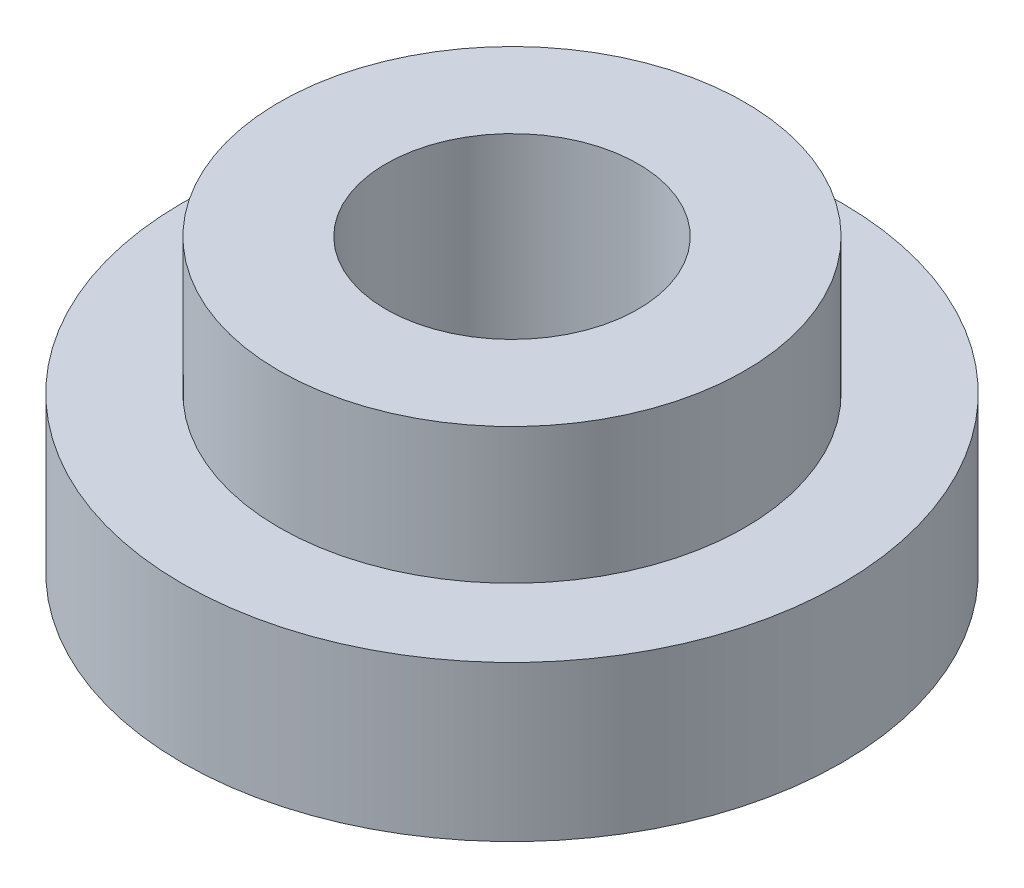
ISO-10303-21;
HEADER;
FILE_DESCRIPTION(('STEP AP214'),'2;1');
FILE_NAME('part.step','',(''),(''),'','','');
FILE_SCHEMA(('AUTOMOTIVE_DESIGN { 1 0 10303 214 1 1 1 1 }'));
ENDSEC;
DATA;
#1=APPLICATION_CONTEXT('core data for automotive mechanical design processes');
#2=APPLICATION_PROTOCOL_DEFINITION('international standard','automotive_design',2000,#1);
#3=PRODUCT_CONTEXT('',#1,'mechanical');
#4=PRODUCT('Part','Part','',(#3));
#5=PRODUCT_RELATED_PRODUCT_CATEGORY('part','',(#4));
#6=PRODUCT_DEFINITION_FORMATION('','',#4);
#7=PRODUCT_DEFINITION_CONTEXT('part definition',#1,'design');
#8=PRODUCT_DEFINITION('design','',#6,#7);
#9=PRODUCT_DEFINITION_SHAPE('','',#8);
#10=(LENGTH_UNIT() NAMED_UNIT(*) SI_UNIT(.MILLI.,.METRE.));
#11=(NAMED_UNIT(*) PLANE_ANGLE_UNIT() SI_UNIT($,.RADIAN.));
#12=(NAMED_UNIT(*) SI_UNIT($,.STERADIAN.) SOLID_ANGLE_UNIT());
#13=UNCERTAINTY_MEASURE_WITH_UNIT(LENGTH_MEASURE(1.E-05),#10,'distance_accuracy_value','');
#14=(GEOMETRIC_REPRESENTATION_CONTEXT(3) GLOBAL_UNCERTAINTY_ASSIGNED_CONTEXT((#13)) GLOBAL_UNIT_ASSIGNED_CONTEXT((#10,
#11,#12)) REPRESENTATION_CONTEXT('',''));
#15=CARTESIAN_POINT('',(0.,0.,0.));
#16=DIRECTION('',(0.,0.,1.));
#17=DIRECTION('',(1.,0.,0.));
#18=AXIS2_PLACEMENT_3D('',#15,#16,#17);
#19=CARTESIAN_POINT('',(0.,2.032,0.));
#20=DIRECTION('',(0.,-1.,0.));
#21=DIRECTION('',(0.,0.,-1.));
#22=AXIS2_PLACEMENT_3D('',#19,#20,#21);
#23=CYLINDRICAL_SURFACE('',#22,4.318);
#24=CARTESIAN_POINT('',(0.,2.032,0.));
#25=DIRECTION('',(0.,1.,0.));
#26=DIRECTION('',(0.,0.,1.));
#27=AXIS2_PLACEMENT_3D('',#24,#25,#26);
#28=CIRCLE('',#27,4.318);
#29=CARTESIAN_POINT('',(0.,2.032,4.318));
#30=VERTEX_POINT('',#29);
#31=EDGE_CURVE('E41',#30,#30,#28,.T.);
#32=ORIENTED_EDGE('',*,*,#31,.F.);
#33=EDGE_LOOP('',(#32));
#34=FACE_BOUND('',#33,.T.);
#35=CARTESIAN_POINT('',(0.,0.,0.));
#36=DIRECTION('',(0.,1.,0.));
#37=DIRECTION('',(0.,0.,1.));
#38=AXIS2_PLACEMENT_3D('',#35,#36,#37);
#39=CIRCLE('',#38,4.318);
#40=CARTESIAN_POINT('',(0.,0.,4.318));
#41=VERTEX_POINT('',#40);
#42=EDGE_CURVE('E37',#41,#41,#39,.T.);
#43=ORIENTED_EDGE('',*,*,#42,.T.);
#44=EDGE_LOOP('',(#43));
#45=FACE_BOUND('',#44,.T.);
#46=ADVANCED_FACE('F34',(#34,#45),#23,.T.);
#47=CARTESIAN_POINT('',(0.,2.032,0.));
#48=DIRECTION('',(0.,1.,0.));
#49=DIRECTION('',(0.,0.,1.));
#50=AXIS2_PLACEMENT_3D('',#47,#48,#49);
#51=PLANE('',#50);
#52=CARTESIAN_POINT('',(0.,2.032,0.));
#53=DIRECTION('',(0.,1.,0.));
#54=DIRECTION('',(0.,0.,1.));
#55=AXIS2_PLACEMENT_3D('',#52,#53,#54);
#56=CIRCLE('',#55,3.048);
#57=CARTESIAN_POINT('',(0.,2.032,3.048));
#58=VERTEX_POINT('',#57);
#59=EDGE_CURVE('E10',#58,#58,#56,.T.);
#60=ORIENTED_EDGE('',*,*,#59,.F.);
#61=EDGE_LOOP('',(#60));
#62=FACE_BOUND('',#61,.T.);
#63=ORIENTED_EDGE('',*,*,#31,.T.);
#64=EDGE_LOOP('',(#63));
#65=FACE_BOUND('',#64,.T.);
#66=ADVANCED_FACE('F78',(#62,#65),#51,.T.);
#67=CARTESIAN_POINT('',(0.,0.,0.));
#68=DIRECTION('',(0.,1.,0.));
#69=DIRECTION('',(0.,0.,1.));
#70=AXIS2_PLACEMENT_3D('',#67,#68,#69);
#71=PLANE('',#70);
#72=CARTESIAN_POINT('',(0.,0.,0.));
#73=DIRECTION('',(0.,1.,0.));
#74=DIRECTION('',(0.,0.,1.));
#75=AXIS2_PLACEMENT_3D('',#72,#73,#74);
#76=CIRCLE('',#75,1.651);
#77=CARTESIAN_POINT('',(0.,0.,1.651));
#78=VERTEX_POINT('',#77);
#79=EDGE_CURVE('E50',#78,#78,#76,.T.);
#80=ORIENTED_EDGE('',*,*,#79,.T.);
#81=EDGE_LOOP('',(#80));
#82=FACE_BOUND('',#81,.T.);
#83=ORIENTED_EDGE('',*,*,#42,.F.);
#84=EDGE_LOOP('',(#83));
#85=FACE_BOUND('',#84,.T.);
#86=ADVANCED_FACE('F57',(#82,#85),#71,.F.);
#87=CARTESIAN_POINT('',(0.,3.81,0.));
#88=DIRECTION('',(0.,-1.,0.));
#89=DIRECTION('',(0.,0.,-1.));
#90=AXIS2_PLACEMENT_3D('',#87,#88,#89);
#91=CYLINDRICAL_SURFACE('',#90,3.048);
#92=CARTESIAN_POINT('',(0.,3.81,0.));
#93=DIRECTION('',(0.,1.,0.));
#94=DIRECTION('',(0.,0.,1.));
#95=AXIS2_PLACEMENT_3D('',#92,#93,#94);
#96=CIRCLE('',#95,3.048);
#97=CARTESIAN_POINT('',(0.,3.81,3.048));
#98=VERTEX_POINT('',#97);
#99=EDGE_CURVE('E47',#98,#98,#96,.T.);
#100=ORIENTED_EDGE('',*,*,#99,.F.);
#101=EDGE_LOOP('',(#100));
#102=FACE_BOUND('',#101,.T.);
#103=ORIENTED_EDGE('',*,*,#59,.T.);
#104=EDGE_LOOP('',(#103));
#105=FACE_BOUND('',#104,.T.);
#106=ADVANCED_FACE('F69',(#102,#105),#91,.T.);
#107=CARTESIAN_POINT('',(0.,3.81,0.));
#108=DIRECTION('',(0.,1.,0.));
#109=DIRECTION('',(0.,0.,1.));
#110=AXIS2_PLACEMENT_3D('',#107,#108,#109);
#111=PLANE('',#110);
#112=CARTESIAN_POINT('',(0.,3.81,0.));
#113=DIRECTION('',(0.,1.,0.));
#114=DIRECTION('',(0.,0.,1.));
#115=AXIS2_PLACEMENT_3D('',#112,#113,#114);
#116=CIRCLE('',#115,1.651);
#117=CARTESIAN_POINT('',(0.,3.81,1.651));
#118=VERTEX_POINT('',#117);
#119=EDGE_CURVE('E51',#118,#118,#116,.T.);
#120=ORIENTED_EDGE('',*,*,#119,.F.);
#121=EDGE_LOOP('',(#120));
#122=FACE_BOUND('',#121,.T.);
#123=ORIENTED_EDGE('',*,*,#99,.T.);
#124=EDGE_LOOP('',(#123));
#125=FACE_BOUND('',#124,.T.);
#126=ADVANCED_FACE('F63',(#122,#125),#111,.T.);
#127=CARTESIAN_POINT('',(0.,0.,0.));
#128=DIRECTION('',(0.,1.,0.));
#129=DIRECTION('',(0.,0.,1.));
#130=AXIS2_PLACEMENT_3D('',#127,#128,#129);
#131=CYLINDRICAL_SURFACE('',#130,1.651);
#132=ORIENTED_EDGE('',*,*,#79,.F.);
#133=EDGE_LOOP('',(#132));
#134=FACE_BOUND('',#133,.T.);
#135=ORIENTED_EDGE('',*,*,#119,.T.);
#136=EDGE_LOOP('',(#135));
#137=FACE_BOUND('',#136,.T.);
#138=ADVANCED_FACE('F60',(#134,#137),#131,.F.);
#139=CLOSED_SHELL('',(#46,#66,#86,#106,#126,#138));
#140=MANIFOLD_SOLID_BREP('B2',#139);
#141=ADVANCED_BREP_SHAPE_REPRESENTATION('',(#18,#140),#14);
#142=SHAPE_DEFINITION_REPRESENTATION(#9,#141);
ENDSEC;
END-ISO-10303-21;
